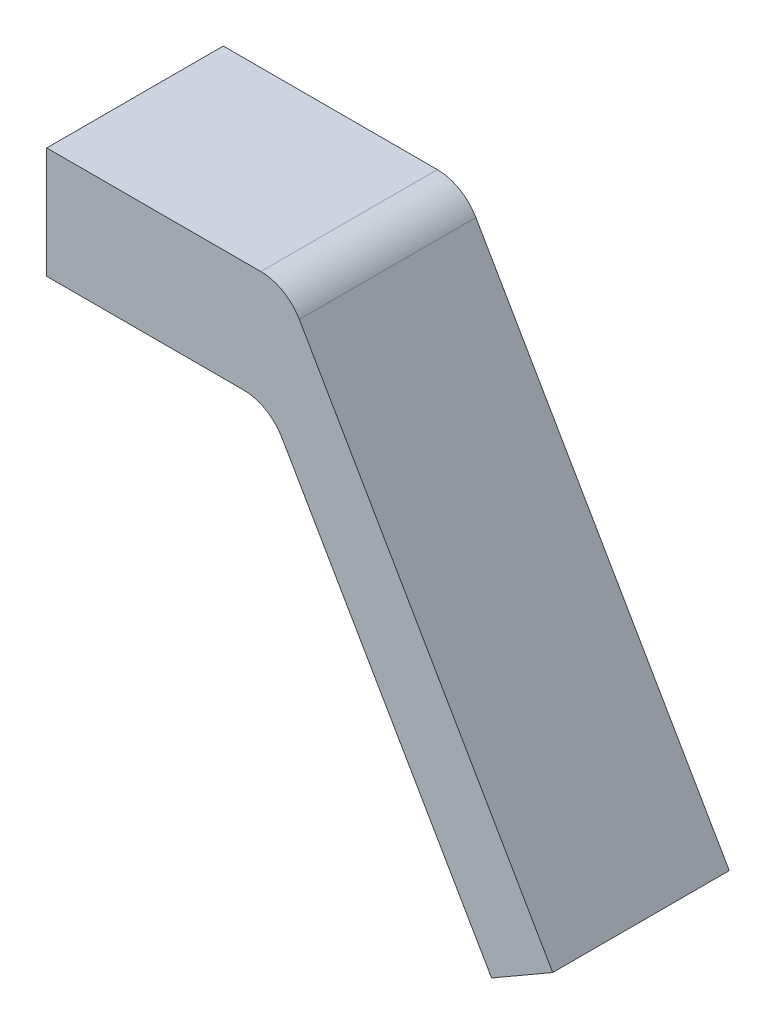
ISO-10303-21;
HEADER;
FILE_DESCRIPTION(('STEP AP214'),'2;1');
FILE_NAME('part.step','',(''),(''),'','','');
FILE_SCHEMA(('AUTOMOTIVE_DESIGN { 1 0 10303 214 1 1 1 1 }'));
ENDSEC;
DATA;
#1=APPLICATION_CONTEXT('core data for automotive mechanical design processes');
#2=APPLICATION_PROTOCOL_DEFINITION('international standard','automotive_design',2000,#1);
#3=PRODUCT_CONTEXT('',#1,'mechanical');
#4=PRODUCT('Part','Part','',(#3));
#5=PRODUCT_RELATED_PRODUCT_CATEGORY('part','',(#4));
#6=PRODUCT_DEFINITION_FORMATION('','',#4);
#7=PRODUCT_DEFINITION_CONTEXT('part definition',#1,'design');
#8=PRODUCT_DEFINITION('design','',#6,#7);
#9=PRODUCT_DEFINITION_SHAPE('','',#8);
#10=(LENGTH_UNIT() NAMED_UNIT(*) SI_UNIT(.MILLI.,.METRE.));
#11=(NAMED_UNIT(*) PLANE_ANGLE_UNIT() SI_UNIT($,.RADIAN.));
#12=(NAMED_UNIT(*) SI_UNIT($,.STERADIAN.) SOLID_ANGLE_UNIT());
#13=UNCERTAINTY_MEASURE_WITH_UNIT(LENGTH_MEASURE(1.E-05),#10,'distance_accuracy_value','');
#14=(GEOMETRIC_REPRESENTATION_CONTEXT(3) GLOBAL_UNCERTAINTY_ASSIGNED_CONTEXT((#13)) GLOBAL_UNIT_ASSIGNED_CONTEXT((#10,
#11,#12)) REPRESENTATION_CONTEXT('',''));
#15=CARTESIAN_POINT('',(0.,0.,0.));
#16=DIRECTION('',(0.,0.,1.));
#17=DIRECTION('',(1.,0.,0.));
#18=AXIS2_PLACEMENT_3D('',#15,#16,#17);
#19=CARTESIAN_POINT('',(-10.,10.,15.875));
#20=DIRECTION('',(1.,0.,0.));
#21=DIRECTION('',(0.,1.,0.));
#22=AXIS2_PLACEMENT_3D('',#19,#20,#21);
#23=PLANE('',#22);
#24=DIRECTION('',(0.,-1.,0.));
#25=VECTOR('',#24,1.);
#26=CARTESIAN_POINT('',(-10.,10.,0.));
#27=LINE('',#26,#25);
#28=CARTESIAN_POINT('',(-10.,10.,0.));
#29=VERTEX_POINT('',#28);
#30=CARTESIAN_POINT('',(-10.,0.,0.));
#31=VERTEX_POINT('',#30);
#32=EDGE_CURVE('E113',#29,#31,#27,.T.);
#33=ORIENTED_EDGE('',*,*,#32,.T.);
#34=DIRECTION('',(0.,0.,-1.));
#35=VECTOR('',#34,1.);
#36=CARTESIAN_POINT('',(-10.,0.,15.875));
#37=LINE('',#36,#35);
#38=CARTESIAN_POINT('',(-10.,0.,15.875));
#39=VERTEX_POINT('',#38);
#40=EDGE_CURVE('E97',#39,#31,#37,.T.);
#41=ORIENTED_EDGE('',*,*,#40,.F.);
#42=DIRECTION('',(0.,-1.,0.));
#43=VECTOR('',#42,1.);
#44=CARTESIAN_POINT('',(-10.,10.,15.875));
#45=LINE('',#44,#43);
#46=CARTESIAN_POINT('',(-10.,10.,15.875));
#47=VERTEX_POINT('',#46);
#48=EDGE_CURVE('E100',#47,#39,#45,.T.);
#49=ORIENTED_EDGE('',*,*,#48,.F.);
#50=DIRECTION('',(0.,0.,-1.));
#51=VECTOR('',#50,1.);
#52=CARTESIAN_POINT('',(-10.,10.,15.875));
#53=LINE('',#52,#51);
#54=EDGE_CURVE('E154',#47,#29,#53,.T.);
#55=ORIENTED_EDGE('',*,*,#54,.T.);
#56=EDGE_LOOP('',(#33,#41,#49,#55));
#57=FACE_BOUND('',#56,.T.);
#58=ADVANCED_FACE('F31',(#57),#23,.F.);
#59=CARTESIAN_POINT('',(-10.,0.,15.875));
#60=DIRECTION('',(0.,1.,0.));
#61=DIRECTION('',(0.,0.,1.));
#62=AXIS2_PLACEMENT_3D('',#59,#60,#61);
#63=PLANE('',#62);
#64=DIRECTION('',(1.,0.,0.));
#65=VECTOR('',#64,1.);
#66=CARTESIAN_POINT('',(-10.,0.,0.));
#67=LINE('',#66,#65);
#68=CARTESIAN_POINT('',(7.69059892324149,0.,0.));
#69=VERTEX_POINT('',#68);
#70=EDGE_CURVE('E137',#31,#69,#67,.T.);
#71=ORIENTED_EDGE('',*,*,#70,.T.);
#72=DIRECTION('',(0.,0.,-1.));
#73=VECTOR('',#72,1.);
#74=CARTESIAN_POINT('',(7.69059892324149,0.,15.875));
#75=LINE('',#74,#73);
#76=CARTESIAN_POINT('',(7.69059892324149,0.,15.875));
#77=VERTEX_POINT('',#76);
#78=EDGE_CURVE('E52',#69,#77,#75,.F.);
#79=ORIENTED_EDGE('',*,*,#78,.T.);
#80=DIRECTION('',(1.,0.,0.));
#81=VECTOR('',#80,1.);
#82=CARTESIAN_POINT('',(-10.,0.,15.875));
#83=LINE('',#82,#81);
#84=EDGE_CURVE('E93',#39,#77,#83,.T.);
#85=ORIENTED_EDGE('',*,*,#84,.F.);
#86=ORIENTED_EDGE('',*,*,#40,.T.);
#87=EDGE_LOOP('',(#71,#79,#85,#86));
#88=FACE_BOUND('',#87,.T.);
#89=ADVANCED_FACE('F95',(#88),#63,.F.);
#90=CARTESIAN_POINT('',(10.,0.,15.875));
#91=DIRECTION('',(0.86602540378444,0.499999999999998,0.));
#92=DIRECTION('',(-0.499999999999998,0.86602540378444,0.));
#93=AXIS2_PLACEMENT_3D('',#90,#91,#92);
#94=PLANE('',#93);
#95=DIRECTION('',(0.499999999999998,-0.86602540378444,0.));
#96=VECTOR('',#95,1.);
#97=CARTESIAN_POINT('',(10.,0.,15.875));
#98=LINE('',#97,#96);
#99=CARTESIAN_POINT('',(11.1547005383793,-2.00000000000001,15.875));
#100=VERTEX_POINT('',#99);
#101=CARTESIAN_POINT('',(29.9999999999999,-34.6410161513776,15.875));
#102=VERTEX_POINT('',#101);
#103=EDGE_CURVE('E99',#100,#102,#98,.T.);
#104=ORIENTED_EDGE('',*,*,#103,.F.);
#105=DIRECTION('',(0.,0.,-1.));
#106=VECTOR('',#105,1.);
#107=CARTESIAN_POINT('',(11.1547005383793,-2.00000000000001,0.));
#108=LINE('',#107,#106);
#109=CARTESIAN_POINT('',(11.1547005383793,-2.00000000000001,0.));
#110=VERTEX_POINT('',#109);
#111=EDGE_CURVE('E130',#100,#110,#108,.T.);
#112=ORIENTED_EDGE('',*,*,#111,.T.);
#113=DIRECTION('',(0.499999999999998,-0.86602540378444,0.));
#114=VECTOR('',#113,1.);
#115=CARTESIAN_POINT('',(10.,0.,0.));
#116=LINE('',#115,#114);
#117=CARTESIAN_POINT('',(29.9999999999999,-34.6410161513776,0.));
#118=VERTEX_POINT('',#117);
#119=EDGE_CURVE('E139',#110,#118,#116,.T.);
#120=ORIENTED_EDGE('',*,*,#119,.T.);
#121=DIRECTION('',(0.,0.,-1.));
#122=VECTOR('',#121,1.);
#123=CARTESIAN_POINT('',(29.9999999999999,-34.6410161513776,15.875));
#124=LINE('',#123,#122);
#125=EDGE_CURVE('E115',#102,#118,#124,.T.);
#126=ORIENTED_EDGE('',*,*,#125,.F.);
#127=EDGE_LOOP('',(#104,#112,#120,#126));
#128=FACE_BOUND('',#127,.T.);
#129=ADVANCED_FACE('F144',(#128),#94,.F.);
#130=CARTESIAN_POINT('',(29.9999999999999,-34.6410161513776,15.875));
#131=DIRECTION('',(-0.499999999999999,0.866025403784439,0.));
#132=DIRECTION('',(-0.86602540378444,-0.499999999999999,0.));
#133=AXIS2_PLACEMENT_3D('',#130,#131,#132);
#134=PLANE('',#133);
#135=DIRECTION('',(0.866025403784439,0.499999999999999,0.));
#136=VECTOR('',#135,1.);
#137=CARTESIAN_POINT('',(29.9999999999999,-34.6410161513776,0.));
#138=LINE('',#137,#136);
#139=CARTESIAN_POINT('',(35.4992613140311,-31.4660161513776,0.));
#140=VERTEX_POINT('',#139);
#141=EDGE_CURVE('E157',#118,#140,#138,.T.);
#142=ORIENTED_EDGE('',*,*,#141,.T.);
#143=DIRECTION('',(0.,0.,-1.));
#144=VECTOR('',#143,1.);
#145=CARTESIAN_POINT('',(35.4992613140311,-31.4660161513776,15.875));
#146=LINE('',#145,#144);
#147=CARTESIAN_POINT('',(35.4992613140311,-31.4660161513776,15.875));
#148=VERTEX_POINT('',#147);
#149=EDGE_CURVE('E121',#148,#140,#146,.T.);
#150=ORIENTED_EDGE('',*,*,#149,.F.);
#151=DIRECTION('',(0.866025403784439,0.499999999999999,0.));
#152=VECTOR('',#151,1.);
#153=CARTESIAN_POINT('',(29.9999999999999,-34.6410161513776,15.875));
#154=LINE('',#153,#152);
#155=EDGE_CURVE('E147',#102,#148,#154,.T.);
#156=ORIENTED_EDGE('',*,*,#155,.F.);
#157=ORIENTED_EDGE('',*,*,#125,.T.);
#158=EDGE_LOOP('',(#142,#150,#156,#157));
#159=FACE_BOUND('',#158,.T.);
#160=ADVANCED_FACE('F184',(#159),#134,.F.);
#161=CARTESIAN_POINT('',(35.4992613140311,-31.4660161513776,15.875));
#162=DIRECTION('',(-0.86602540378444,-0.499999999999998,0.));
#163=DIRECTION('',(0.499999999999998,-0.86602540378444,0.));
#164=AXIS2_PLACEMENT_3D('',#161,#162,#163);
#165=PLANE('',#164);
#166=DIRECTION('',(-0.499999999999998,0.86602540378444,0.));
#167=VECTOR('',#166,1.);
#168=CARTESIAN_POINT('',(35.4992613140311,-31.4660161513776,0.));
#169=LINE('',#168,#167);
#170=CARTESIAN_POINT('',(12.7135462651913,7.99999999999999,0.));
#171=VERTEX_POINT('',#170);
#172=EDGE_CURVE('E159',#140,#171,#169,.T.);
#173=ORIENTED_EDGE('',*,*,#172,.T.);
#174=DIRECTION('',(0.,0.,-1.));
#175=VECTOR('',#174,1.);
#176=CARTESIAN_POINT('',(12.7135462651913,7.99999999999999,15.875));
#177=LINE('',#176,#175);
#178=CARTESIAN_POINT('',(12.7135462651913,7.99999999999999,15.875));
#179=VERTEX_POINT('',#178);
#180=EDGE_CURVE('E126',#171,#179,#177,.F.);
#181=ORIENTED_EDGE('',*,*,#180,.T.);
#182=DIRECTION('',(-0.499999999999998,0.86602540378444,0.));
#183=VECTOR('',#182,1.);
#184=CARTESIAN_POINT('',(35.4992613140311,-31.4660161513776,15.875));
#185=LINE('',#184,#183);
#186=EDGE_CURVE('E149',#148,#179,#185,.T.);
#187=ORIENTED_EDGE('',*,*,#186,.F.);
#188=ORIENTED_EDGE('',*,*,#149,.T.);
#189=EDGE_LOOP('',(#173,#181,#187,#188));
#190=FACE_BOUND('',#189,.T.);
#191=ADVANCED_FACE('F168',(#190),#165,.F.);
#192=CARTESIAN_POINT('',(11.558845726812,10.,15.875));
#193=DIRECTION('',(0.,-1.,0.));
#194=DIRECTION('',(1.,0.,0.));
#195=AXIS2_PLACEMENT_3D('',#192,#193,#194);
#196=PLANE('',#195);
#197=DIRECTION('',(-1.,0.,0.));
#198=VECTOR('',#197,1.);
#199=CARTESIAN_POINT('',(11.558845726812,10.,15.875));
#200=LINE('',#199,#198);
#201=CARTESIAN_POINT('',(9.24944465005351,10.,15.875));
#202=VERTEX_POINT('',#201);
#203=EDGE_CURVE('E106',#202,#47,#200,.T.);
#204=ORIENTED_EDGE('',*,*,#203,.F.);
#205=DIRECTION('',(0.,0.,-1.));
#206=VECTOR('',#205,1.);
#207=CARTESIAN_POINT('',(9.24944465005351,10.,15.875));
#208=LINE('',#207,#206);
#209=CARTESIAN_POINT('',(9.24944465005351,10.,0.));
#210=VERTEX_POINT('',#209);
#211=EDGE_CURVE('E114',#202,#210,#208,.T.);
#212=ORIENTED_EDGE('',*,*,#211,.T.);
#213=DIRECTION('',(-1.,0.,0.));
#214=VECTOR('',#213,1.);
#215=CARTESIAN_POINT('',(11.558845726812,10.,0.));
#216=LINE('',#215,#214);
#217=EDGE_CURVE('E110',#210,#29,#216,.T.);
#218=ORIENTED_EDGE('',*,*,#217,.T.);
#219=ORIENTED_EDGE('',*,*,#54,.F.);
#220=EDGE_LOOP('',(#204,#212,#218,#219));
#221=FACE_BOUND('',#220,.T.);
#222=ADVANCED_FACE('F176',(#221),#196,.F.);
#223=CARTESIAN_POINT('',(-10.,0.,15.875));
#224=DIRECTION('',(0.,0.,1.));
#225=DIRECTION('',(1.,0.,0.));
#226=AXIS2_PLACEMENT_3D('',#223,#224,#225);
#227=PLANE('',#226);
#228=ORIENTED_EDGE('',*,*,#186,.T.);
#229=CARTESIAN_POINT('',(9.24944465005351,6.,15.875));
#230=DIRECTION('',(0.,0.,1.));
#231=DIRECTION('',(1.,0.,0.));
#232=AXIS2_PLACEMENT_3D('',#229,#230,#231);
#233=CIRCLE('',#232,4.);
#234=EDGE_CURVE('E128',#179,#202,#233,.T.);
#235=ORIENTED_EDGE('',*,*,#234,.T.);
#236=ORIENTED_EDGE('',*,*,#203,.T.);
#237=ORIENTED_EDGE('',*,*,#48,.T.);
#238=ORIENTED_EDGE('',*,*,#84,.T.);
#239=CARTESIAN_POINT('',(7.69059892324149,-4.,15.875));
#240=DIRECTION('',(0.,0.,1.));
#241=DIRECTION('',(1.,0.,0.));
#242=AXIS2_PLACEMENT_3D('',#239,#240,#241);
#243=CIRCLE('',#242,4.);
#244=EDGE_CURVE('E11',#77,#100,#243,.F.);
#245=ORIENTED_EDGE('',*,*,#244,.T.);
#246=ORIENTED_EDGE('',*,*,#103,.T.);
#247=ORIENTED_EDGE('',*,*,#155,.T.);
#248=EDGE_LOOP('',(#228,#235,#236,#237,#238,#245,#246,#247));
#249=FACE_BOUND('',#248,.T.);
#250=ADVANCED_FACE('F104',(#249),#227,.T.);
#251=CARTESIAN_POINT('',(-10.,0.,0.));
#252=DIRECTION('',(0.,0.,1.));
#253=DIRECTION('',(1.,0.,0.));
#254=AXIS2_PLACEMENT_3D('',#251,#252,#253);
#255=PLANE('',#254);
#256=ORIENTED_EDGE('',*,*,#217,.F.);
#257=CARTESIAN_POINT('',(9.24944465005351,6.,0.));
#258=DIRECTION('',(0.,0.,1.));
#259=DIRECTION('',(1.,0.,0.));
#260=AXIS2_PLACEMENT_3D('',#257,#258,#259);
#261=CIRCLE('',#260,4.);
#262=EDGE_CURVE('E118',#210,#171,#261,.F.);
#263=ORIENTED_EDGE('',*,*,#262,.T.);
#264=ORIENTED_EDGE('',*,*,#172,.F.);
#265=ORIENTED_EDGE('',*,*,#141,.F.);
#266=ORIENTED_EDGE('',*,*,#119,.F.);
#267=CARTESIAN_POINT('',(7.69059892324149,-4.,0.));
#268=DIRECTION('',(0.,0.,1.));
#269=DIRECTION('',(1.,0.,0.));
#270=AXIS2_PLACEMENT_3D('',#267,#268,#269);
#271=CIRCLE('',#270,4.);
#272=EDGE_CURVE('E39',#110,#69,#271,.T.);
#273=ORIENTED_EDGE('',*,*,#272,.T.);
#274=ORIENTED_EDGE('',*,*,#70,.F.);
#275=ORIENTED_EDGE('',*,*,#32,.F.);
#276=EDGE_LOOP('',(#256,#263,#264,#265,#266,#273,#274,#275));
#277=FACE_BOUND('',#276,.T.);
#278=ADVANCED_FACE('F136',(#277),#255,.F.);
#279=CARTESIAN_POINT('',(9.24944465005351,6.,15.875));
#280=DIRECTION('',(0.,0.,-1.));
#281=DIRECTION('',(-1.,0.,0.));
#282=AXIS2_PLACEMENT_3D('',#279,#280,#281);
#283=CYLINDRICAL_SURFACE('',#282,4.);
#284=ORIENTED_EDGE('',*,*,#234,.F.);
#285=ORIENTED_EDGE('',*,*,#180,.F.);
#286=ORIENTED_EDGE('',*,*,#262,.F.);
#287=ORIENTED_EDGE('',*,*,#211,.F.);
#288=EDGE_LOOP('',(#284,#285,#286,#287));
#289=FACE_BOUND('',#288,.T.);
#290=ADVANCED_FACE('F174',(#289),#283,.T.);
#291=CARTESIAN_POINT('',(7.69059892324149,-4.,15.875));
#292=DIRECTION('',(0.,0.,1.));
#293=DIRECTION('',(1.,0.,0.));
#294=AXIS2_PLACEMENT_3D('',#291,#292,#293);
#295=CYLINDRICAL_SURFACE('',#294,4.);
#296=ORIENTED_EDGE('',*,*,#244,.F.);
#297=ORIENTED_EDGE('',*,*,#78,.F.);
#298=ORIENTED_EDGE('',*,*,#272,.F.);
#299=ORIENTED_EDGE('',*,*,#111,.F.);
#300=EDGE_LOOP('',(#296,#297,#298,#299));
#301=FACE_BOUND('',#300,.T.);
#302=ADVANCED_FACE('F33',(#301),#295,.F.);
#303=CLOSED_SHELL('',(#58,#89,#129,#160,#191,#222,#250,#278,#290,#302));
#304=MANIFOLD_SOLID_BREP('B2',#303);
#305=ADVANCED_BREP_SHAPE_REPRESENTATION('',(#18,#304),#14);
#306=SHAPE_DEFINITION_REPRESENTATION(#9,#305);
ENDSEC;
END-ISO-10303-21;
